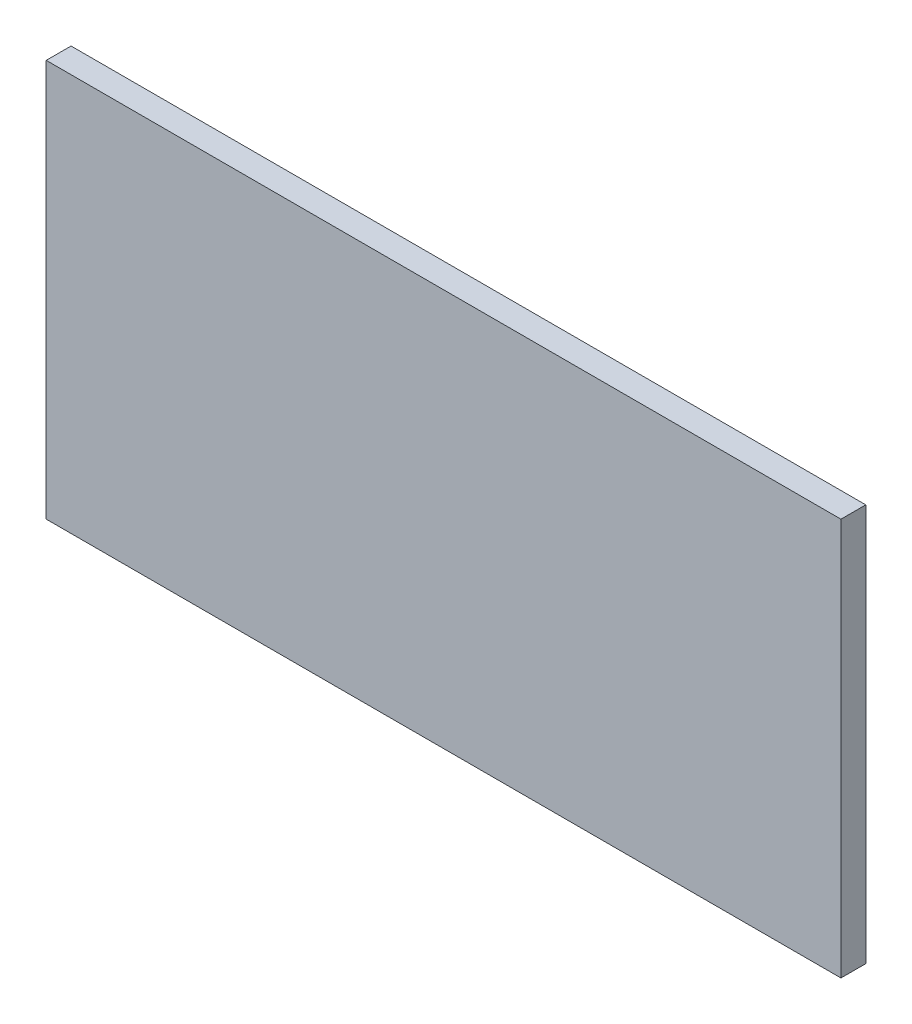
ISO-10303-21;
HEADER;
FILE_DESCRIPTION(('STEP AP214'),'2;1');
FILE_NAME('part.step','',(''),(''),'','','');
FILE_SCHEMA(('AUTOMOTIVE_DESIGN { 1 0 10303 214 1 1 1 1 }'));
ENDSEC;
DATA;
#1=APPLICATION_CONTEXT('core data for automotive mechanical design processes');
#2=APPLICATION_PROTOCOL_DEFINITION('international standard','automotive_design',2000,#1);
#3=PRODUCT_CONTEXT('',#1,'mechanical');
#4=PRODUCT('Part','Part','',(#3));
#5=PRODUCT_RELATED_PRODUCT_CATEGORY('part','',(#4));
#6=PRODUCT_DEFINITION_FORMATION('','',#4);
#7=PRODUCT_DEFINITION_CONTEXT('part definition',#1,'design');
#8=PRODUCT_DEFINITION('design','',#6,#7);
#9=PRODUCT_DEFINITION_SHAPE('','',#8);
#10=(LENGTH_UNIT() NAMED_UNIT(*) SI_UNIT(.MILLI.,.METRE.));
#11=(NAMED_UNIT(*) PLANE_ANGLE_UNIT() SI_UNIT($,.RADIAN.));
#12=(NAMED_UNIT(*) SI_UNIT($,.STERADIAN.) SOLID_ANGLE_UNIT());
#13=UNCERTAINTY_MEASURE_WITH_UNIT(LENGTH_MEASURE(1.E-05),#10,'distance_accuracy_value','');
#14=(GEOMETRIC_REPRESENTATION_CONTEXT(3) GLOBAL_UNCERTAINTY_ASSIGNED_CONTEXT((#13)) GLOBAL_UNIT_ASSIGNED_CONTEXT((#10,
#11,#12)) REPRESENTATION_CONTEXT('',''));
#15=CARTESIAN_POINT('',(0.,0.,0.));
#16=DIRECTION('',(0.,0.,1.));
#17=DIRECTION('',(1.,0.,0.));
#18=AXIS2_PLACEMENT_3D('',#15,#16,#17);
#19=CARTESIAN_POINT('',(50.8,25.4,3.17499999999996));
#20=DIRECTION('',(-1.,0.,0.));
#21=DIRECTION('',(0.,-1.,0.));
#22=AXIS2_PLACEMENT_3D('',#19,#20,#21);
#23=PLANE('',#22);
#24=DIRECTION('',(0.,1.,0.));
#25=VECTOR('',#24,1.);
#26=CARTESIAN_POINT('',(50.8,25.4,-1.11022302462516E-13));
#27=LINE('',#26,#25);
#28=CARTESIAN_POINT('',(50.8,-25.4,0.));
#29=VERTEX_POINT('',#28);
#30=CARTESIAN_POINT('',(50.8,25.4,-1.11022302462516E-13));
#31=VERTEX_POINT('',#30);
#32=EDGE_CURVE('E109',#29,#31,#27,.T.);
#33=ORIENTED_EDGE('',*,*,#32,.T.);
#34=DIRECTION('',(0.,0.,-1.));
#35=VECTOR('',#34,1.);
#36=CARTESIAN_POINT('',(50.8,25.4,3.17499999999996));
#37=LINE('',#36,#35);
#38=CARTESIAN_POINT('',(50.8,25.4,3.17499999999996));
#39=VERTEX_POINT('',#38);
#40=EDGE_CURVE('E11',#39,#31,#37,.T.);
#41=ORIENTED_EDGE('',*,*,#40,.F.);
#42=DIRECTION('',(0.,1.,0.));
#43=VECTOR('',#42,1.);
#44=CARTESIAN_POINT('',(50.8,25.4,3.17499999999996));
#45=LINE('',#44,#43);
#46=CARTESIAN_POINT('',(50.8,-25.4,3.17499999999998));
#47=VERTEX_POINT('',#46);
#48=EDGE_CURVE('E92',#47,#39,#45,.T.);
#49=ORIENTED_EDGE('',*,*,#48,.F.);
#50=DIRECTION('',(0.,0.,-1.));
#51=VECTOR('',#50,1.);
#52=CARTESIAN_POINT('',(50.8,-25.4,3.17499999999998));
#53=LINE('',#52,#51);
#54=EDGE_CURVE('E105',#47,#29,#53,.T.);
#55=ORIENTED_EDGE('',*,*,#54,.T.);
#56=EDGE_LOOP('',(#33,#41,#49,#55));
#57=FACE_BOUND('',#56,.T.);
#58=ADVANCED_FACE('F40',(#57),#23,.F.);
#59=CARTESIAN_POINT('',(-50.8,25.4,3.17499999999996));
#60=DIRECTION('',(0.,-1.,0.));
#61=DIRECTION('',(0.,0.,-1.));
#62=AXIS2_PLACEMENT_3D('',#59,#60,#61);
#63=PLANE('',#62);
#64=DIRECTION('',(-1.,0.,0.));
#65=VECTOR('',#64,1.);
#66=CARTESIAN_POINT('',(-50.8,25.4,-1.11022302462516E-13));
#67=LINE('',#66,#65);
#68=CARTESIAN_POINT('',(-50.8,25.4,-1.11022302462516E-13));
#69=VERTEX_POINT('',#68);
#70=EDGE_CURVE('E97',#31,#69,#67,.T.);
#71=ORIENTED_EDGE('',*,*,#70,.T.);
#72=DIRECTION('',(0.,0.,-1.));
#73=VECTOR('',#72,1.);
#74=CARTESIAN_POINT('',(-50.8,25.4,3.17499999999996));
#75=LINE('',#74,#73);
#76=CARTESIAN_POINT('',(-50.8,25.4,3.17499999999996));
#77=VERTEX_POINT('',#76);
#78=EDGE_CURVE('E49',#77,#69,#75,.T.);
#79=ORIENTED_EDGE('',*,*,#78,.F.);
#80=DIRECTION('',(-1.,0.,0.));
#81=VECTOR('',#80,1.);
#82=CARTESIAN_POINT('',(-50.8,25.4,3.17499999999996));
#83=LINE('',#82,#81);
#84=EDGE_CURVE('E87',#39,#77,#83,.T.);
#85=ORIENTED_EDGE('',*,*,#84,.F.);
#86=ORIENTED_EDGE('',*,*,#40,.T.);
#87=EDGE_LOOP('',(#71,#79,#85,#86));
#88=FACE_BOUND('',#87,.T.);
#89=ADVANCED_FACE('F96',(#88),#63,.F.);
#90=CARTESIAN_POINT('',(-50.8,25.4,3.17499999999996));
#91=DIRECTION('',(1.,0.,0.));
#92=DIRECTION('',(0.,1.,0.));
#93=AXIS2_PLACEMENT_3D('',#90,#91,#92);
#94=PLANE('',#93);
#95=DIRECTION('',(0.,-1.,0.));
#96=VECTOR('',#95,1.);
#97=CARTESIAN_POINT('',(-50.8,25.4,-1.11022302462516E-13));
#98=LINE('',#97,#96);
#99=CARTESIAN_POINT('',(-50.8,-25.4,0.));
#100=VERTEX_POINT('',#99);
#101=EDGE_CURVE('E74',#69,#100,#98,.T.);
#102=ORIENTED_EDGE('',*,*,#101,.T.);
#103=DIRECTION('',(0.,0.,-1.));
#104=VECTOR('',#103,1.);
#105=CARTESIAN_POINT('',(-50.8,-25.4,3.17499999999998));
#106=LINE('',#105,#104);
#107=CARTESIAN_POINT('',(-50.8,-25.4,3.17499999999998));
#108=VERTEX_POINT('',#107);
#109=EDGE_CURVE('E99',#108,#100,#106,.T.);
#110=ORIENTED_EDGE('',*,*,#109,.F.);
#111=DIRECTION('',(0.,-1.,0.));
#112=VECTOR('',#111,1.);
#113=CARTESIAN_POINT('',(-50.8,25.4,3.17499999999996));
#114=LINE('',#113,#112);
#115=EDGE_CURVE('E90',#77,#108,#114,.T.);
#116=ORIENTED_EDGE('',*,*,#115,.F.);
#117=ORIENTED_EDGE('',*,*,#78,.T.);
#118=EDGE_LOOP('',(#102,#110,#116,#117));
#119=FACE_BOUND('',#118,.T.);
#120=ADVANCED_FACE('F100',(#119),#94,.F.);
#121=CARTESIAN_POINT('',(-50.8,-25.4,3.17499999999998));
#122=DIRECTION('',(0.,1.,0.));
#123=DIRECTION('',(0.,0.,1.));
#124=AXIS2_PLACEMENT_3D('',#121,#122,#123);
#125=PLANE('',#124);
#126=DIRECTION('',(1.,0.,0.));
#127=VECTOR('',#126,1.);
#128=CARTESIAN_POINT('',(-50.8,-25.4,0.));
#129=LINE('',#128,#127);
#130=EDGE_CURVE('E80',#100,#29,#129,.T.);
#131=ORIENTED_EDGE('',*,*,#130,.T.);
#132=ORIENTED_EDGE('',*,*,#54,.F.);
#133=DIRECTION('',(1.,0.,0.));
#134=VECTOR('',#133,1.);
#135=CARTESIAN_POINT('',(-50.8,-25.4,3.17499999999998));
#136=LINE('',#135,#134);
#137=EDGE_CURVE('E57',#108,#47,#136,.T.);
#138=ORIENTED_EDGE('',*,*,#137,.F.);
#139=ORIENTED_EDGE('',*,*,#109,.T.);
#140=EDGE_LOOP('',(#131,#132,#138,#139));
#141=FACE_BOUND('',#140,.T.);
#142=ADVANCED_FACE('F123',(#141),#125,.F.);
#143=CARTESIAN_POINT('',(0.,0.,3.17499999999998));
#144=DIRECTION('',(0.,0.,1.));
#145=DIRECTION('',(1.,0.,0.));
#146=AXIS2_PLACEMENT_3D('',#143,#144,#145);
#147=PLANE('',#146);
#148=ORIENTED_EDGE('',*,*,#48,.T.);
#149=ORIENTED_EDGE('',*,*,#84,.T.);
#150=ORIENTED_EDGE('',*,*,#115,.T.);
#151=ORIENTED_EDGE('',*,*,#137,.T.);
#152=EDGE_LOOP('',(#148,#149,#150,#151));
#153=FACE_BOUND('',#152,.T.);
#154=ADVANCED_FACE('F88',(#153),#147,.T.);
#155=CARTESIAN_POINT('',(0.,0.,0.));
#156=DIRECTION('',(0.,0.,1.));
#157=DIRECTION('',(1.,0.,0.));
#158=AXIS2_PLACEMENT_3D('',#155,#156,#157);
#159=PLANE('',#158);
#160=ORIENTED_EDGE('',*,*,#32,.F.);
#161=ORIENTED_EDGE('',*,*,#130,.F.);
#162=ORIENTED_EDGE('',*,*,#101,.F.);
#163=ORIENTED_EDGE('',*,*,#70,.F.);
#164=EDGE_LOOP('',(#160,#161,#162,#163));
#165=FACE_BOUND('',#164,.T.);
#166=ADVANCED_FACE('F126',(#165),#159,.F.);
#167=CLOSED_SHELL('',(#58,#89,#120,#142,#154,#166));
#168=MANIFOLD_SOLID_BREP('B2',#167);
#169=ADVANCED_BREP_SHAPE_REPRESENTATION('',(#18,#168),#14);
#170=SHAPE_DEFINITION_REPRESENTATION(#9,#169);
ENDSEC;
END-ISO-10303-21;
